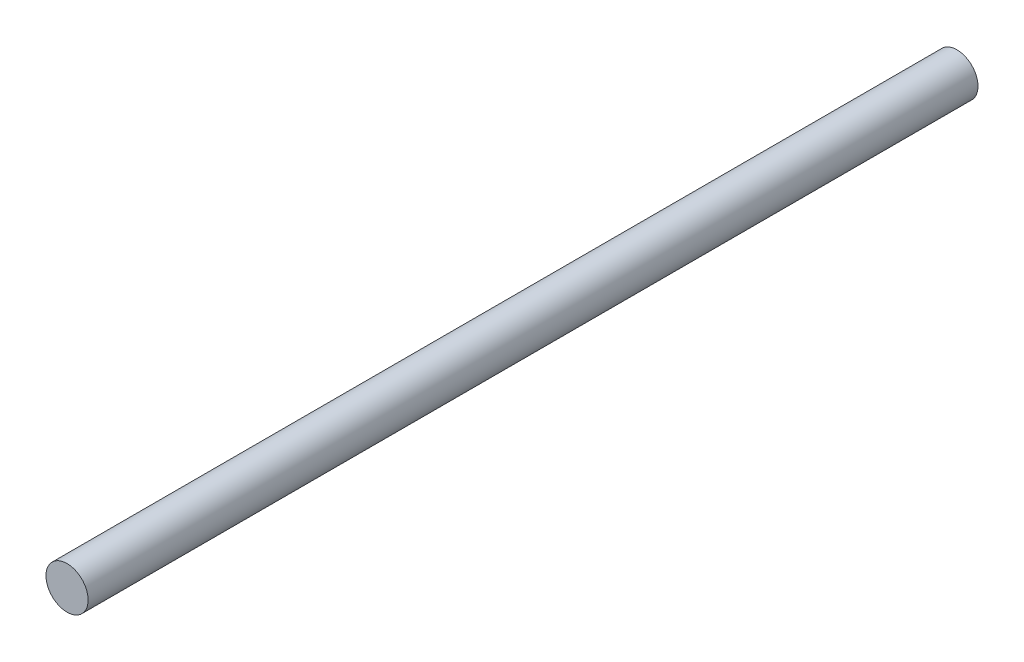
ISO-10303-21;
HEADER;
FILE_DESCRIPTION(('STEP AP214'),'2;1');
FILE_NAME('part.step','',(''),(''),'','','');
FILE_SCHEMA(('AUTOMOTIVE_DESIGN { 1 0 10303 214 1 1 1 1 }'));
ENDSEC;
DATA;
#1=APPLICATION_CONTEXT('core data for automotive mechanical design processes');
#2=APPLICATION_PROTOCOL_DEFINITION('international standard','automotive_design',2000,#1);
#3=PRODUCT_CONTEXT('',#1,'mechanical');
#4=PRODUCT('Part','Part','',(#3));
#5=PRODUCT_RELATED_PRODUCT_CATEGORY('part','',(#4));
#6=PRODUCT_DEFINITION_FORMATION('','',#4);
#7=PRODUCT_DEFINITION_CONTEXT('part definition',#1,'design');
#8=PRODUCT_DEFINITION('design','',#6,#7);
#9=PRODUCT_DEFINITION_SHAPE('','',#8);
#10=(LENGTH_UNIT() NAMED_UNIT(*) SI_UNIT(.MILLI.,.METRE.));
#11=(NAMED_UNIT(*) PLANE_ANGLE_UNIT() SI_UNIT($,.RADIAN.));
#12=(NAMED_UNIT(*) SI_UNIT($,.STERADIAN.) SOLID_ANGLE_UNIT());
#13=UNCERTAINTY_MEASURE_WITH_UNIT(LENGTH_MEASURE(1.E-05),#10,'distance_accuracy_value','');
#14=(GEOMETRIC_REPRESENTATION_CONTEXT(3) GLOBAL_UNCERTAINTY_ASSIGNED_CONTEXT((#13)) GLOBAL_UNIT_ASSIGNED_CONTEXT((#10,
#11,#12)) REPRESENTATION_CONTEXT('',''));
#15=CARTESIAN_POINT('',(0.,0.,0.));
#16=DIRECTION('',(0.,0.,1.));
#17=DIRECTION('',(1.,0.,0.));
#18=AXIS2_PLACEMENT_3D('',#15,#16,#17);
#19=CARTESIAN_POINT('',(0.,0.,482.6));
#20=DIRECTION('',(0.,0.,-1.));
#21=DIRECTION('',(-1.,0.,0.));
#22=AXIS2_PLACEMENT_3D('',#19,#20,#21);
#23=CYLINDRICAL_SURFACE('',#22,11.43);
#24=CARTESIAN_POINT('',(0.,0.,482.6));
#25=DIRECTION('',(0.,0.,1.));
#26=DIRECTION('',(1.,0.,0.));
#27=AXIS2_PLACEMENT_3D('',#24,#25,#26);
#28=CIRCLE('',#27,11.43);
#29=CARTESIAN_POINT('',(11.43,0.,482.6));
#30=VERTEX_POINT('',#29);
#31=EDGE_CURVE('E10',#30,#30,#28,.T.);
#32=ORIENTED_EDGE('',*,*,#31,.F.);
#33=EDGE_LOOP('',(#32));
#34=FACE_BOUND('',#33,.T.);
#35=CARTESIAN_POINT('',(0.,0.,0.));
#36=DIRECTION('',(0.,0.,1.));
#37=DIRECTION('',(1.,0.,0.));
#38=AXIS2_PLACEMENT_3D('',#35,#36,#37);
#39=CIRCLE('',#38,11.43);
#40=CARTESIAN_POINT('',(11.43,0.,0.));
#41=VERTEX_POINT('',#40);
#42=EDGE_CURVE('E34',#41,#41,#39,.T.);
#43=ORIENTED_EDGE('',*,*,#42,.T.);
#44=EDGE_LOOP('',(#43));
#45=FACE_BOUND('',#44,.T.);
#46=ADVANCED_FACE('F31',(#34,#45),#23,.T.);
#47=CARTESIAN_POINT('',(0.,0.,482.6));
#48=DIRECTION('',(0.,0.,1.));
#49=DIRECTION('',(1.,0.,0.));
#50=AXIS2_PLACEMENT_3D('',#47,#48,#49);
#51=PLANE('',#50);
#52=ORIENTED_EDGE('',*,*,#31,.T.);
#53=EDGE_LOOP('',(#52));
#54=FACE_BOUND('',#53,.T.);
#55=ADVANCED_FACE('F46',(#54),#51,.T.);
#56=CARTESIAN_POINT('',(0.,0.,0.));
#57=DIRECTION('',(0.,0.,1.));
#58=DIRECTION('',(1.,0.,0.));
#59=AXIS2_PLACEMENT_3D('',#56,#57,#58);
#60=PLANE('',#59);
#61=ORIENTED_EDGE('',*,*,#42,.F.);
#62=EDGE_LOOP('',(#61));
#63=FACE_BOUND('',#62,.T.);
#64=ADVANCED_FACE('F44',(#63),#60,.F.);
#65=CLOSED_SHELL('',(#46,#55,#64));
#66=MANIFOLD_SOLID_BREP('B2',#65);
#67=ADVANCED_BREP_SHAPE_REPRESENTATION('',(#18,#66),#14);
#68=SHAPE_DEFINITION_REPRESENTATION(#9,#67);
ENDSEC;
END-ISO-10303-21;
